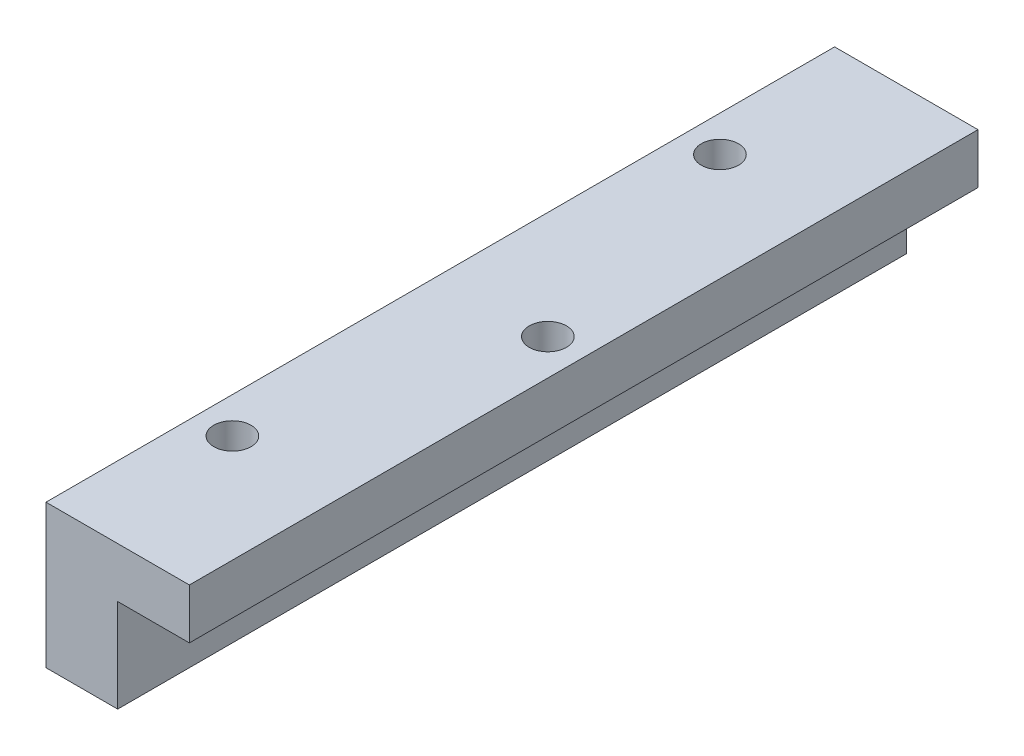
ISO-10303-21;
HEADER;
FILE_DESCRIPTION(('STEP AP214'),'2;1');
FILE_NAME('part.step','',(''),(''),'','','');
FILE_SCHEMA(('AUTOMOTIVE_DESIGN { 1 0 10303 214 1 1 1 1 }'));
ENDSEC;
DATA;
#1=APPLICATION_CONTEXT('core data for automotive mechanical design processes');
#2=APPLICATION_PROTOCOL_DEFINITION('international standard','automotive_design',2000,#1);
#3=PRODUCT_CONTEXT('',#1,'mechanical');
#4=PRODUCT('Part','Part','',(#3));
#5=PRODUCT_RELATED_PRODUCT_CATEGORY('part','',(#4));
#6=PRODUCT_DEFINITION_FORMATION('','',#4);
#7=PRODUCT_DEFINITION_CONTEXT('part definition',#1,'design');
#8=PRODUCT_DEFINITION('design','',#6,#7);
#9=PRODUCT_DEFINITION_SHAPE('','',#8);
#10=(LENGTH_UNIT() NAMED_UNIT(*) SI_UNIT(.MILLI.,.METRE.));
#11=(NAMED_UNIT(*) PLANE_ANGLE_UNIT() SI_UNIT($,.RADIAN.));
#12=(NAMED_UNIT(*) SI_UNIT($,.STERADIAN.) SOLID_ANGLE_UNIT());
#13=UNCERTAINTY_MEASURE_WITH_UNIT(LENGTH_MEASURE(1.E-05),#10,'distance_accuracy_value','');
#14=(GEOMETRIC_REPRESENTATION_CONTEXT(3) GLOBAL_UNCERTAINTY_ASSIGNED_CONTEXT((#13)) GLOBAL_UNIT_ASSIGNED_CONTEXT((#10,
#11,#12)) REPRESENTATION_CONTEXT('',''));
#15=CARTESIAN_POINT('',(0.,0.,0.));
#16=DIRECTION('',(0.,0.,1.));
#17=DIRECTION('',(1.,0.,0.));
#18=AXIS2_PLACEMENT_3D('',#15,#16,#17);
#19=CARTESIAN_POINT('',(10.,13.,110.));
#20=DIRECTION('',(0.,1.,0.));
#21=DIRECTION('',(0.,0.,1.));
#22=AXIS2_PLACEMENT_3D('',#19,#20,#21);
#23=PLANE('',#22);
#24=DIRECTION('',(1.,0.,0.));
#25=VECTOR('',#24,1.);
#26=CARTESIAN_POINT('',(10.,13.,0.));
#27=LINE('',#26,#25);
#28=CARTESIAN_POINT('',(10.,13.,0.));
#29=VERTEX_POINT('',#28);
#30=CARTESIAN_POINT('',(20.,13.,0.));
#31=VERTEX_POINT('',#30);
#32=EDGE_CURVE('E132',#29,#31,#27,.T.);
#33=ORIENTED_EDGE('',*,*,#32,.T.);
#34=DIRECTION('',(0.,0.,-1.));
#35=VECTOR('',#34,1.);
#36=CARTESIAN_POINT('',(20.,13.,110.));
#37=LINE('',#36,#35);
#38=CARTESIAN_POINT('',(20.,13.,110.));
#39=VERTEX_POINT('',#38);
#40=EDGE_CURVE('E129',#39,#31,#37,.T.);
#41=ORIENTED_EDGE('',*,*,#40,.F.);
#42=DIRECTION('',(1.,0.,0.));
#43=VECTOR('',#42,1.);
#44=CARTESIAN_POINT('',(10.,13.,110.));
#45=LINE('',#44,#43);
#46=CARTESIAN_POINT('',(10.,13.,110.));
#47=VERTEX_POINT('',#46);
#48=EDGE_CURVE('E115',#47,#39,#45,.T.);
#49=ORIENTED_EDGE('',*,*,#48,.F.);
#50=DIRECTION('',(0.,0.,-1.));
#51=VECTOR('',#50,1.);
#52=CARTESIAN_POINT('',(10.,13.,110.));
#53=LINE('',#52,#51);
#54=EDGE_CURVE('E137',#47,#29,#53,.T.);
#55=ORIENTED_EDGE('',*,*,#54,.T.);
#56=EDGE_LOOP('',(#33,#41,#49,#55));
#57=FACE_BOUND('',#56,.T.);
#58=DIRECTION('',(-0.866025403784438,0.,-0.500000000000001));
#59=VECTOR('',#58,1.);
#60=CARTESIAN_POINT('',(37.0406986040721,13.,63.1641361455904));
#61=LINE('',#60,#59);
#62=CARTESIAN_POINT('',(18.95,13.,52.719466436701));
#63=VERTEX_POINT('',#62);
#64=CARTESIAN_POINT('',(15.,13.,50.438932873402));
#65=VERTEX_POINT('',#64);
#66=EDGE_CURVE('E62',#63,#65,#61,.T.);
#67=ORIENTED_EDGE('',*,*,#66,.T.);
#68=DIRECTION('',(-0.866025403784439,0.,0.5));
#69=VECTOR('',#68,1.);
#70=CARTESIAN_POINT('',(-14.5406986040721,13.,67.4942631645126));
#71=LINE('',#70,#69);
#72=CARTESIAN_POINT('',(11.05,13.,52.719466436701));
#73=VERTEX_POINT('',#72);
#74=EDGE_CURVE('E246',#65,#73,#71,.T.);
#75=ORIENTED_EDGE('',*,*,#74,.T.);
#76=DIRECTION('',(0.,0.,1.));
#77=VECTOR('',#76,1.);
#78=CARTESIAN_POINT('',(11.05,13.,110.));
#79=LINE('',#78,#77);
#80=CARTESIAN_POINT('',(11.05,13.,57.280533563299));
#81=VERTEX_POINT('',#80);
#82=EDGE_CURVE('E242',#73,#81,#79,.T.);
#83=ORIENTED_EDGE('',*,*,#82,.T.);
#84=DIRECTION('',(0.866025403784439,0.,0.5));
#85=VECTOR('',#84,1.);
#86=CARTESIAN_POINT('',(33.0906986040721,13.,70.0057368354874));
#87=LINE('',#86,#85);
#88=CARTESIAN_POINT('',(15.,13.,59.5610671265981));
#89=VERTEX_POINT('',#88);
#90=EDGE_CURVE('E238',#81,#89,#87,.T.);
#91=ORIENTED_EDGE('',*,*,#90,.T.);
#92=DIRECTION('',(0.866025403784438,0.,-0.5));
#93=VECTOR('',#92,1.);
#94=CARTESIAN_POINT('',(-10.5906986040721,13.,74.3358638544097));
#95=LINE('',#94,#93);
#96=CARTESIAN_POINT('',(18.95,13.,57.2805335632991));
#97=VERTEX_POINT('',#96);
#98=EDGE_CURVE('E234',#89,#97,#95,.T.);
#99=ORIENTED_EDGE('',*,*,#98,.T.);
#100=DIRECTION('',(0.,0.,-1.));
#101=VECTOR('',#100,1.);
#102=CARTESIAN_POINT('',(18.95,13.,110.));
#103=LINE('',#102,#101);
#104=EDGE_CURVE('E229',#97,#63,#103,.T.);
#105=ORIENTED_EDGE('',*,*,#104,.T.);
#106=EDGE_LOOP('',(#67,#75,#83,#91,#99,#105));
#107=FACE_BOUND('',#106,.T.);
#108=ADVANCED_FACE('F45',(#57,#107),#23,.F.);
#109=CARTESIAN_POINT('',(0.,0.,110.));
#110=DIRECTION('',(1.,0.,0.));
#111=DIRECTION('',(0.,0.,-1.));
#112=AXIS2_PLACEMENT_3D('',#109,#110,#111);
#113=PLANE('',#112);
#114=DIRECTION('',(0.,-1.,0.));
#115=VECTOR('',#114,1.);
#116=CARTESIAN_POINT('',(0.,0.,0.));
#117=LINE('',#116,#115);
#118=CARTESIAN_POINT('',(0.,20.,0.));
#119=VERTEX_POINT('',#118);
#120=CARTESIAN_POINT('',(0.,0.,0.));
#121=VERTEX_POINT('',#120);
#122=EDGE_CURVE('E148',#119,#121,#117,.T.);
#123=ORIENTED_EDGE('',*,*,#122,.T.);
#124=DIRECTION('',(0.,0.,-1.));
#125=VECTOR('',#124,1.);
#126=CARTESIAN_POINT('',(0.,0.,110.));
#127=LINE('',#126,#125);
#128=CARTESIAN_POINT('',(0.,0.,110.));
#129=VERTEX_POINT('',#128);
#130=EDGE_CURVE('E11',#129,#121,#127,.T.);
#131=ORIENTED_EDGE('',*,*,#130,.F.);
#132=DIRECTION('',(0.,-1.,0.));
#133=VECTOR('',#132,1.);
#134=CARTESIAN_POINT('',(0.,0.,110.));
#135=LINE('',#134,#133);
#136=CARTESIAN_POINT('',(0.,20.,110.));
#137=VERTEX_POINT('',#136);
#138=EDGE_CURVE('E166',#137,#129,#135,.T.);
#139=ORIENTED_EDGE('',*,*,#138,.F.);
#140=DIRECTION('',(0.,0.,-1.));
#141=VECTOR('',#140,1.);
#142=CARTESIAN_POINT('',(0.,20.,110.));
#143=LINE('',#142,#141);
#144=EDGE_CURVE('E144',#137,#119,#143,.T.);
#145=ORIENTED_EDGE('',*,*,#144,.T.);
#146=EDGE_LOOP('',(#123,#131,#139,#145));
#147=FACE_BOUND('',#146,.T.);
#148=ADVANCED_FACE('F47',(#147),#113,.F.);
#149=CARTESIAN_POINT('',(0.,0.,110.));
#150=DIRECTION('',(0.,1.,0.));
#151=DIRECTION('',(0.,0.,1.));
#152=AXIS2_PLACEMENT_3D('',#149,#150,#151);
#153=PLANE('',#152);
#154=CARTESIAN_POINT('',(5.,0.,21.));
#155=DIRECTION('',(0.,1.,0.));
#156=DIRECTION('',(0.,0.,1.));
#157=AXIS2_PLACEMENT_3D('',#154,#155,#156);
#158=CIRCLE('',#157,2.6);
#159=CARTESIAN_POINT('',(5.,0.,23.6));
#160=VERTEX_POINT('',#159);
#161=EDGE_CURVE('E153',#160,#160,#158,.T.);
#162=ORIENTED_EDGE('',*,*,#161,.T.);
#163=EDGE_LOOP('',(#162));
#164=FACE_BOUND('',#163,.T.);
#165=CARTESIAN_POINT('',(5.00000000000001,0.,89.));
#166=DIRECTION('',(0.,1.,0.));
#167=DIRECTION('',(0.,0.,1.));
#168=AXIS2_PLACEMENT_3D('',#165,#166,#167);
#169=CIRCLE('',#168,2.6);
#170=CARTESIAN_POINT('',(5.00000000000001,0.,91.6));
#171=VERTEX_POINT('',#170);
#172=EDGE_CURVE('E194',#171,#171,#169,.T.);
#173=ORIENTED_EDGE('',*,*,#172,.T.);
#174=EDGE_LOOP('',(#173));
#175=FACE_BOUND('',#174,.T.);
#176=DIRECTION('',(1.,0.,0.));
#177=VECTOR('',#176,1.);
#178=CARTESIAN_POINT('',(0.,0.,0.));
#179=LINE('',#178,#177);
#180=CARTESIAN_POINT('',(10.,0.,0.));
#181=VERTEX_POINT('',#180);
#182=EDGE_CURVE('E152',#121,#181,#179,.T.);
#183=ORIENTED_EDGE('',*,*,#182,.T.);
#184=DIRECTION('',(0.,0.,-1.));
#185=VECTOR('',#184,1.);
#186=CARTESIAN_POINT('',(10.,0.,110.));
#187=LINE('',#186,#185);
#188=CARTESIAN_POINT('',(10.,0.,110.));
#189=VERTEX_POINT('',#188);
#190=EDGE_CURVE('E55',#189,#181,#187,.T.);
#191=ORIENTED_EDGE('',*,*,#190,.F.);
#192=DIRECTION('',(1.,0.,0.));
#193=VECTOR('',#192,1.);
#194=CARTESIAN_POINT('',(0.,0.,110.));
#195=LINE('',#194,#193);
#196=EDGE_CURVE('E105',#129,#189,#195,.T.);
#197=ORIENTED_EDGE('',*,*,#196,.F.);
#198=ORIENTED_EDGE('',*,*,#130,.T.);
#199=EDGE_LOOP('',(#183,#191,#197,#198));
#200=FACE_BOUND('',#199,.T.);
#201=ADVANCED_FACE('F302',(#164,#175,#200),#153,.F.);
#202=CARTESIAN_POINT('',(10.,0.,110.));
#203=DIRECTION('',(-1.,0.,0.));
#204=DIRECTION('',(0.,0.,1.));
#205=AXIS2_PLACEMENT_3D('',#202,#203,#204);
#206=PLANE('',#205);
#207=DIRECTION('',(0.,1.,0.));
#208=VECTOR('',#207,1.);
#209=CARTESIAN_POINT('',(10.,0.,0.));
#210=LINE('',#209,#208);
#211=EDGE_CURVE('E156',#181,#29,#210,.T.);
#212=ORIENTED_EDGE('',*,*,#211,.T.);
#213=ORIENTED_EDGE('',*,*,#54,.F.);
#214=DIRECTION('',(0.,1.,0.));
#215=VECTOR('',#214,1.);
#216=CARTESIAN_POINT('',(10.,0.,110.));
#217=LINE('',#216,#215);
#218=EDGE_CURVE('E122',#189,#47,#217,.T.);
#219=ORIENTED_EDGE('',*,*,#218,.F.);
#220=ORIENTED_EDGE('',*,*,#190,.T.);
#221=EDGE_LOOP('',(#212,#213,#219,#220));
#222=FACE_BOUND('',#221,.T.);
#223=ADVANCED_FACE('F177',(#222),#206,.F.);
#224=CARTESIAN_POINT('',(20.,20.,110.));
#225=DIRECTION('',(-1.,0.,0.));
#226=DIRECTION('',(0.,-1.,0.));
#227=AXIS2_PLACEMENT_3D('',#224,#225,#226);
#228=PLANE('',#227);
#229=DIRECTION('',(0.,1.,0.));
#230=VECTOR('',#229,1.);
#231=CARTESIAN_POINT('',(20.,20.,0.));
#232=LINE('',#231,#230);
#233=CARTESIAN_POINT('',(20.,20.,0.));
#234=VERTEX_POINT('',#233);
#235=EDGE_CURVE('E161',#31,#234,#232,.T.);
#236=ORIENTED_EDGE('',*,*,#235,.T.);
#237=DIRECTION('',(0.,0.,-1.));
#238=VECTOR('',#237,1.);
#239=CARTESIAN_POINT('',(20.,20.,110.));
#240=LINE('',#239,#238);
#241=CARTESIAN_POINT('',(20.,20.,110.));
#242=VERTEX_POINT('',#241);
#243=EDGE_CURVE('E138',#242,#234,#240,.T.);
#244=ORIENTED_EDGE('',*,*,#243,.F.);
#245=DIRECTION('',(0.,1.,0.));
#246=VECTOR('',#245,1.);
#247=CARTESIAN_POINT('',(20.,20.,110.));
#248=LINE('',#247,#246);
#249=EDGE_CURVE('E119',#39,#242,#248,.T.);
#250=ORIENTED_EDGE('',*,*,#249,.F.);
#251=ORIENTED_EDGE('',*,*,#40,.T.);
#252=EDGE_LOOP('',(#236,#244,#250,#251));
#253=FACE_BOUND('',#252,.T.);
#254=ADVANCED_FACE('F140',(#253),#228,.F.);
#255=CARTESIAN_POINT('',(0.,20.,110.));
#256=DIRECTION('',(0.,-1.,0.));
#257=DIRECTION('',(0.,0.,-1.));
#258=AXIS2_PLACEMENT_3D('',#255,#256,#257);
#259=PLANE('',#258);
#260=CARTESIAN_POINT('',(15.,20.,55.));
#261=DIRECTION('',(0.,-1.,0.));
#262=DIRECTION('',(0.,0.,-1.));
#263=AXIS2_PLACEMENT_3D('',#260,#261,#262);
#264=CIRCLE('',#263,2.6);
#265=CARTESIAN_POINT('',(15.,20.,52.4));
#266=VERTEX_POINT('',#265);
#267=EDGE_CURVE('E49',#266,#266,#264,.T.);
#268=ORIENTED_EDGE('',*,*,#267,.T.);
#269=EDGE_LOOP('',(#268));
#270=FACE_BOUND('',#269,.T.);
#271=CARTESIAN_POINT('',(5.,20.,21.));
#272=DIRECTION('',(0.,1.,0.));
#273=DIRECTION('',(0.,0.,1.));
#274=AXIS2_PLACEMENT_3D('',#271,#272,#273);
#275=CIRCLE('',#274,2.6);
#276=CARTESIAN_POINT('',(5.,20.,23.6));
#277=VERTEX_POINT('',#276);
#278=EDGE_CURVE('E198',#277,#277,#275,.T.);
#279=ORIENTED_EDGE('',*,*,#278,.F.);
#280=EDGE_LOOP('',(#279));
#281=FACE_BOUND('',#280,.T.);
#282=CARTESIAN_POINT('',(5.00000000000001,20.,89.));
#283=DIRECTION('',(0.,1.,0.));
#284=DIRECTION('',(0.,0.,1.));
#285=AXIS2_PLACEMENT_3D('',#282,#283,#284);
#286=CIRCLE('',#285,2.6);
#287=CARTESIAN_POINT('',(5.00000000000001,20.,91.6));
#288=VERTEX_POINT('',#287);
#289=EDGE_CURVE('E199',#288,#288,#286,.T.);
#290=ORIENTED_EDGE('',*,*,#289,.F.);
#291=EDGE_LOOP('',(#290));
#292=FACE_BOUND('',#291,.T.);
#293=DIRECTION('',(-1.,0.,0.));
#294=VECTOR('',#293,1.);
#295=CARTESIAN_POINT('',(0.,20.,0.));
#296=LINE('',#295,#294);
#297=EDGE_CURVE('E97',#234,#119,#296,.T.);
#298=ORIENTED_EDGE('',*,*,#297,.T.);
#299=ORIENTED_EDGE('',*,*,#144,.F.);
#300=DIRECTION('',(-1.,0.,0.));
#301=VECTOR('',#300,1.);
#302=CARTESIAN_POINT('',(10.,20.,110.));
#303=LINE('',#302,#301);
#304=EDGE_CURVE('E71',#242,#137,#303,.T.);
#305=ORIENTED_EDGE('',*,*,#304,.F.);
#306=ORIENTED_EDGE('',*,*,#243,.T.);
#307=EDGE_LOOP('',(#298,#299,#305,#306));
#308=FACE_BOUND('',#307,.T.);
#309=ADVANCED_FACE('F181',(#270,#281,#292,#308),#259,.F.);
#310=CARTESIAN_POINT('',(0.,0.,110.));
#311=DIRECTION('',(0.,0.,-1.));
#312=DIRECTION('',(-1.,0.,0.));
#313=AXIS2_PLACEMENT_3D('',#310,#311,#312);
#314=PLANE('',#313);
#315=ORIENTED_EDGE('',*,*,#138,.T.);
#316=ORIENTED_EDGE('',*,*,#196,.T.);
#317=ORIENTED_EDGE('',*,*,#218,.T.);
#318=ORIENTED_EDGE('',*,*,#48,.T.);
#319=ORIENTED_EDGE('',*,*,#249,.T.);
#320=ORIENTED_EDGE('',*,*,#304,.T.);
#321=EDGE_LOOP('',(#315,#316,#317,#318,#319,#320));
#322=FACE_BOUND('',#321,.T.);
#323=ADVANCED_FACE('F117',(#322),#314,.F.);
#324=CARTESIAN_POINT('',(0.,0.,0.));
#325=DIRECTION('',(0.,0.,-1.));
#326=DIRECTION('',(-1.,0.,0.));
#327=AXIS2_PLACEMENT_3D('',#324,#325,#326);
#328=PLANE('',#327);
#329=ORIENTED_EDGE('',*,*,#122,.F.);
#330=ORIENTED_EDGE('',*,*,#297,.F.);
#331=ORIENTED_EDGE('',*,*,#235,.F.);
#332=ORIENTED_EDGE('',*,*,#32,.F.);
#333=ORIENTED_EDGE('',*,*,#211,.F.);
#334=ORIENTED_EDGE('',*,*,#182,.F.);
#335=EDGE_LOOP('',(#329,#330,#331,#332,#333,#334));
#336=FACE_BOUND('',#335,.T.);
#337=ADVANCED_FACE('F180',(#336),#328,.T.);
#338=CARTESIAN_POINT('',(5.00000000000001,-90.,89.));
#339=DIRECTION('',(0.,1.,0.));
#340=DIRECTION('',(0.,0.,1.));
#341=AXIS2_PLACEMENT_3D('',#338,#339,#340);
#342=CYLINDRICAL_SURFACE('',#341,2.6);
#343=ORIENTED_EDGE('',*,*,#289,.T.);
#344=EDGE_LOOP('',(#343));
#345=FACE_BOUND('',#344,.T.);
#346=ORIENTED_EDGE('',*,*,#172,.F.);
#347=EDGE_LOOP('',(#346));
#348=FACE_BOUND('',#347,.T.);
#349=ADVANCED_FACE('F317',(#345,#348),#342,.F.);
#350=CARTESIAN_POINT('',(5.,-90.,21.));
#351=DIRECTION('',(0.,1.,0.));
#352=DIRECTION('',(0.,0.,1.));
#353=AXIS2_PLACEMENT_3D('',#350,#351,#352);
#354=CYLINDRICAL_SURFACE('',#353,2.6);
#355=ORIENTED_EDGE('',*,*,#278,.T.);
#356=EDGE_LOOP('',(#355));
#357=FACE_BOUND('',#356,.T.);
#358=ORIENTED_EDGE('',*,*,#161,.F.);
#359=EDGE_LOOP('',(#358));
#360=FACE_BOUND('',#359,.T.);
#361=ADVANCED_FACE('F318',(#357,#360),#354,.F.);
#362=CARTESIAN_POINT('',(37.0406986040721,16.,63.1641361455904));
#363=DIRECTION('',(-0.500000000000001,0.,0.866025403784438));
#364=DIRECTION('',(0.866025403784438,0.,0.500000000000001));
#365=AXIS2_PLACEMENT_3D('',#362,#363,#364);
#366=PLANE('',#365);
#367=ORIENTED_EDGE('',*,*,#66,.F.);
#368=DIRECTION('',(0.,-1.,0.));
#369=VECTOR('',#368,1.);
#370=CARTESIAN_POINT('',(18.95,16.,52.719466436701));
#371=LINE('',#370,#369);
#372=CARTESIAN_POINT('',(18.95,16.,52.719466436701));
#373=VERTEX_POINT('',#372);
#374=EDGE_CURVE('E225',#373,#63,#371,.T.);
#375=ORIENTED_EDGE('',*,*,#374,.F.);
#376=DIRECTION('',(-0.866025403784438,0.,-0.500000000000001));
#377=VECTOR('',#376,1.);
#378=CARTESIAN_POINT('',(37.0406986040721,16.,63.1641361455904));
#379=LINE('',#378,#377);
#380=CARTESIAN_POINT('',(15.,16.,50.438932873402));
#381=VERTEX_POINT('',#380);
#382=EDGE_CURVE('E233',#373,#381,#379,.T.);
#383=ORIENTED_EDGE('',*,*,#382,.T.);
#384=DIRECTION('',(0.,-1.,0.));
#385=VECTOR('',#384,1.);
#386=CARTESIAN_POINT('',(15.,16.,50.438932873402));
#387=LINE('',#386,#385);
#388=EDGE_CURVE('E203',#381,#65,#387,.T.);
#389=ORIENTED_EDGE('',*,*,#388,.T.);
#390=EDGE_LOOP('',(#367,#375,#383,#389));
#391=FACE_BOUND('',#390,.T.);
#392=ADVANCED_FACE('F323',(#391),#366,.T.);
#393=CARTESIAN_POINT('',(-14.5406986040721,16.,67.4942631645126));
#394=DIRECTION('',(0.5,0.,0.866025403784439));
#395=DIRECTION('',(0.866025403784439,0.,-0.5));
#396=AXIS2_PLACEMENT_3D('',#393,#394,#395);
#397=PLANE('',#396);
#398=ORIENTED_EDGE('',*,*,#74,.F.);
#399=ORIENTED_EDGE('',*,*,#388,.F.);
#400=DIRECTION('',(-0.866025403784439,0.,0.5));
#401=VECTOR('',#400,1.);
#402=CARTESIAN_POINT('',(-14.5406986040721,16.,67.4942631645126));
#403=LINE('',#402,#401);
#404=CARTESIAN_POINT('',(11.05,16.,52.719466436701));
#405=VERTEX_POINT('',#404);
#406=EDGE_CURVE('E267',#381,#405,#403,.T.);
#407=ORIENTED_EDGE('',*,*,#406,.T.);
#408=DIRECTION('',(0.,-1.,0.));
#409=VECTOR('',#408,1.);
#410=CARTESIAN_POINT('',(11.05,16.,52.719466436701));
#411=LINE('',#410,#409);
#412=EDGE_CURVE('E209',#405,#73,#411,.T.);
#413=ORIENTED_EDGE('',*,*,#412,.T.);
#414=EDGE_LOOP('',(#398,#399,#407,#413));
#415=FACE_BOUND('',#414,.T.);
#416=ADVANCED_FACE('F373',(#415),#397,.T.);
#417=CARTESIAN_POINT('',(11.05,16.,110.));
#418=DIRECTION('',(1.,0.,0.));
#419=DIRECTION('',(0.,0.,-1.));
#420=AXIS2_PLACEMENT_3D('',#417,#418,#419);
#421=PLANE('',#420);
#422=ORIENTED_EDGE('',*,*,#82,.F.);
#423=ORIENTED_EDGE('',*,*,#412,.F.);
#424=DIRECTION('',(0.,0.,1.));
#425=VECTOR('',#424,1.);
#426=CARTESIAN_POINT('',(11.05,16.,110.));
#427=LINE('',#426,#425);
#428=CARTESIAN_POINT('',(11.05,16.,57.280533563299));
#429=VERTEX_POINT('',#428);
#430=EDGE_CURVE('E263',#405,#429,#427,.T.);
#431=ORIENTED_EDGE('',*,*,#430,.T.);
#432=DIRECTION('',(0.,-1.,0.));
#433=VECTOR('',#432,1.);
#434=CARTESIAN_POINT('',(11.05,16.,57.280533563299));
#435=LINE('',#434,#433);
#436=EDGE_CURVE('E213',#429,#81,#435,.T.);
#437=ORIENTED_EDGE('',*,*,#436,.T.);
#438=EDGE_LOOP('',(#422,#423,#431,#437));
#439=FACE_BOUND('',#438,.T.);
#440=ADVANCED_FACE('F381',(#439),#421,.T.);
#441=CARTESIAN_POINT('',(33.0906986040721,16.,70.0057368354874));
#442=DIRECTION('',(0.5,0.,-0.866025403784439));
#443=DIRECTION('',(-0.866025403784439,0.,-0.5));
#444=AXIS2_PLACEMENT_3D('',#441,#442,#443);
#445=PLANE('',#444);
#446=ORIENTED_EDGE('',*,*,#90,.F.);
#447=ORIENTED_EDGE('',*,*,#436,.F.);
#448=DIRECTION('',(0.866025403784439,0.,0.5));
#449=VECTOR('',#448,1.);
#450=CARTESIAN_POINT('',(33.0906986040721,16.,70.0057368354874));
#451=LINE('',#450,#449);
#452=CARTESIAN_POINT('',(15.,16.,59.5610671265981));
#453=VERTEX_POINT('',#452);
#454=EDGE_CURVE('E259',#429,#453,#451,.T.);
#455=ORIENTED_EDGE('',*,*,#454,.T.);
#456=DIRECTION('',(0.,-1.,0.));
#457=VECTOR('',#456,1.);
#458=CARTESIAN_POINT('',(15.,16.,59.5610671265981));
#459=LINE('',#458,#457);
#460=EDGE_CURVE('E217',#453,#89,#459,.T.);
#461=ORIENTED_EDGE('',*,*,#460,.T.);
#462=EDGE_LOOP('',(#446,#447,#455,#461));
#463=FACE_BOUND('',#462,.T.);
#464=ADVANCED_FACE('F391',(#463),#445,.T.);
#465=CARTESIAN_POINT('',(-10.5906986040721,16.,74.3358638544097));
#466=DIRECTION('',(-0.500000000000001,0.,-0.866025403784438));
#467=DIRECTION('',(-0.866025403784438,0.,0.500000000000001));
#468=AXIS2_PLACEMENT_3D('',#465,#466,#467);
#469=PLANE('',#468);
#470=ORIENTED_EDGE('',*,*,#98,.F.);
#471=ORIENTED_EDGE('',*,*,#460,.F.);
#472=DIRECTION('',(0.866025403784438,0.,-0.5));
#473=VECTOR('',#472,1.);
#474=CARTESIAN_POINT('',(-10.5906986040721,16.,74.3358638544097));
#475=LINE('',#474,#473);
#476=CARTESIAN_POINT('',(18.95,16.,57.2805335632991));
#477=VERTEX_POINT('',#476);
#478=EDGE_CURVE('E255',#453,#477,#475,.T.);
#479=ORIENTED_EDGE('',*,*,#478,.T.);
#480=DIRECTION('',(0.,-1.,0.));
#481=VECTOR('',#480,1.);
#482=CARTESIAN_POINT('',(18.95,16.,57.2805335632991));
#483=LINE('',#482,#481);
#484=EDGE_CURVE('E221',#477,#97,#483,.T.);
#485=ORIENTED_EDGE('',*,*,#484,.T.);
#486=EDGE_LOOP('',(#470,#471,#479,#485));
#487=FACE_BOUND('',#486,.T.);
#488=ADVANCED_FACE('F401',(#487),#469,.T.);
#489=CARTESIAN_POINT('',(18.95,16.,110.));
#490=DIRECTION('',(-1.,0.,0.));
#491=DIRECTION('',(0.,0.,1.));
#492=AXIS2_PLACEMENT_3D('',#489,#490,#491);
#493=PLANE('',#492);
#494=ORIENTED_EDGE('',*,*,#104,.F.);
#495=ORIENTED_EDGE('',*,*,#484,.F.);
#496=DIRECTION('',(0.,0.,-1.));
#497=VECTOR('',#496,1.);
#498=CARTESIAN_POINT('',(18.95,16.,110.));
#499=LINE('',#498,#497);
#500=EDGE_CURVE('E228',#477,#373,#499,.T.);
#501=ORIENTED_EDGE('',*,*,#500,.T.);
#502=ORIENTED_EDGE('',*,*,#374,.T.);
#503=EDGE_LOOP('',(#494,#495,#501,#502));
#504=FACE_BOUND('',#503,.T.);
#505=ADVANCED_FACE('F292',(#504),#493,.T.);
#506=CARTESIAN_POINT('',(0.,16.,0.));
#507=DIRECTION('',(0.,1.,0.));
#508=DIRECTION('',(0.,0.,1.));
#509=AXIS2_PLACEMENT_3D('',#506,#507,#508);
#510=PLANE('',#509);
#511=CARTESIAN_POINT('',(15.,16.,55.));
#512=DIRECTION('',(0.,-1.,0.));
#513=DIRECTION('',(0.,0.,-1.));
#514=AXIS2_PLACEMENT_3D('',#511,#512,#513);
#515=CIRCLE('',#514,2.6);
#516=CARTESIAN_POINT('',(15.,16.,52.4));
#517=VERTEX_POINT('',#516);
#518=EDGE_CURVE('E274',#517,#517,#515,.T.);
#519=ORIENTED_EDGE('',*,*,#518,.F.);
#520=EDGE_LOOP('',(#519));
#521=FACE_BOUND('',#520,.T.);
#522=ORIENTED_EDGE('',*,*,#382,.F.);
#523=ORIENTED_EDGE('',*,*,#500,.F.);
#524=ORIENTED_EDGE('',*,*,#478,.F.);
#525=ORIENTED_EDGE('',*,*,#454,.F.);
#526=ORIENTED_EDGE('',*,*,#430,.F.);
#527=ORIENTED_EDGE('',*,*,#406,.F.);
#528=EDGE_LOOP('',(#522,#523,#524,#525,#526,#527));
#529=FACE_BOUND('',#528,.T.);
#530=ADVANCED_FACE('F287',(#521,#529),#510,.F.);
#531=CARTESIAN_POINT('',(15.,29.,55.));
#532=DIRECTION('',(0.,-1.,0.));
#533=DIRECTION('',(0.,0.,-1.));
#534=AXIS2_PLACEMENT_3D('',#531,#532,#533);
#535=CYLINDRICAL_SURFACE('',#534,2.6);
#536=ORIENTED_EDGE('',*,*,#518,.T.);
#537=EDGE_LOOP('',(#536));
#538=FACE_BOUND('',#537,.T.);
#539=ORIENTED_EDGE('',*,*,#267,.F.);
#540=EDGE_LOOP('',(#539));
#541=FACE_BOUND('',#540,.T.);
#542=ADVANCED_FACE('F285',(#538,#541),#535,.F.);
#543=CLOSED_SHELL('',(#108,#148,#201,#223,#254,#309,#323,#337,#349,#361,#392,#416,#440,#464,
#488,#505,#530,#542));
#544=MANIFOLD_SOLID_BREP('B2',#543);
#545=ADVANCED_BREP_SHAPE_REPRESENTATION('',(#18,#544),#14);
#546=SHAPE_DEFINITION_REPRESENTATION(#9,#545);
ENDSEC;
END-ISO-10303-21;
